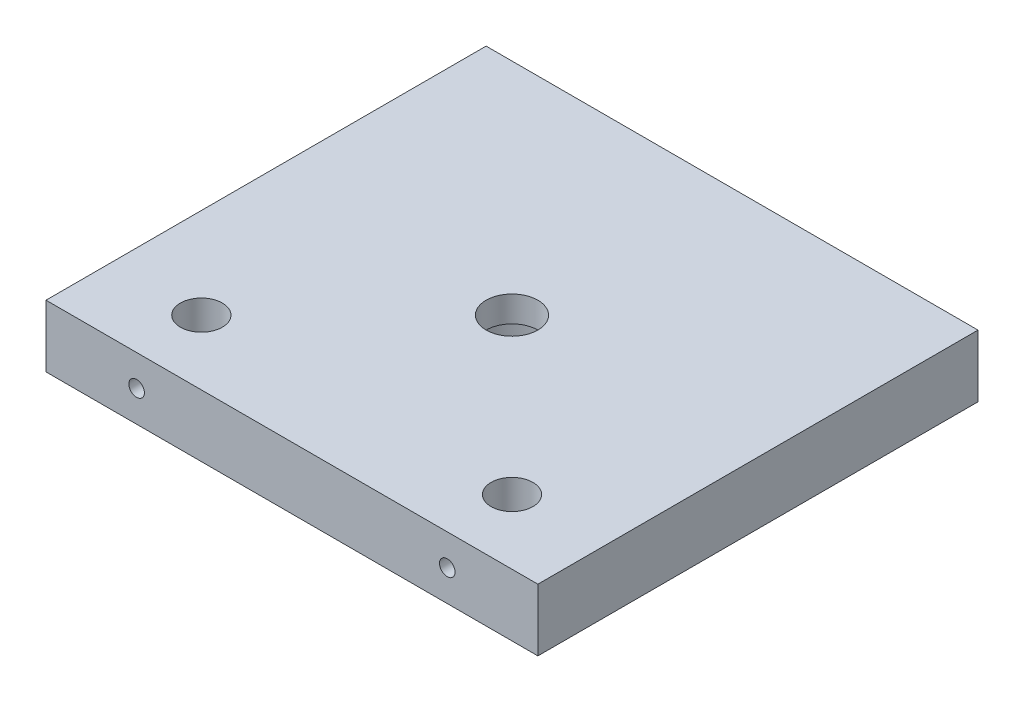
ISO-10303-21;
HEADER;
FILE_DESCRIPTION(('STEP AP214'),'2;1');
FILE_NAME('part.step','',(''),(''),'','','');
FILE_SCHEMA(('AUTOMOTIVE_DESIGN { 1 0 10303 214 1 1 1 1 }'));
ENDSEC;
DATA;
#1=APPLICATION_CONTEXT('core data for automotive mechanical design processes');
#2=APPLICATION_PROTOCOL_DEFINITION('international standard','automotive_design',2000,#1);
#3=PRODUCT_CONTEXT('',#1,'mechanical');
#4=PRODUCT('Part','Part','',(#3));
#5=PRODUCT_RELATED_PRODUCT_CATEGORY('part','',(#4));
#6=PRODUCT_DEFINITION_FORMATION('','',#4);
#7=PRODUCT_DEFINITION_CONTEXT('part definition',#1,'design');
#8=PRODUCT_DEFINITION('design','',#6,#7);
#9=PRODUCT_DEFINITION_SHAPE('','',#8);
#10=(LENGTH_UNIT() NAMED_UNIT(*) SI_UNIT(.MILLI.,.METRE.));
#11=(NAMED_UNIT(*) PLANE_ANGLE_UNIT() SI_UNIT($,.RADIAN.));
#12=(NAMED_UNIT(*) SI_UNIT($,.STERADIAN.) SOLID_ANGLE_UNIT());
#13=UNCERTAINTY_MEASURE_WITH_UNIT(LENGTH_MEASURE(1.E-05),#10,'distance_accuracy_value','');
#14=(GEOMETRIC_REPRESENTATION_CONTEXT(3) GLOBAL_UNCERTAINTY_ASSIGNED_CONTEXT((#13)) GLOBAL_UNIT_ASSIGNED_CONTEXT((#10,
#11,#12)) REPRESENTATION_CONTEXT('',''));
#15=CARTESIAN_POINT('',(0.,0.,0.));
#16=DIRECTION('',(0.,0.,1.));
#17=DIRECTION('',(1.,0.,0.));
#18=AXIS2_PLACEMENT_3D('',#15,#16,#17);
#19=CARTESIAN_POINT('',(0.,6.,42.5));
#20=DIRECTION('',(0.,-1.,0.));
#21=DIRECTION('',(0.,0.,-1.));
#22=AXIS2_PLACEMENT_3D('',#19,#20,#21);
#23=CYLINDRICAL_SURFACE('',#22,5.);
#24=CARTESIAN_POINT('',(0.,6.,42.5));
#25=DIRECTION('',(0.,-1.,0.));
#26=DIRECTION('',(0.,0.,-1.));
#27=AXIS2_PLACEMENT_3D('',#24,#25,#26);
#28=CIRCLE('',#27,5.);
#29=CARTESIAN_POINT('',(0.,6.,37.5));
#30=VERTEX_POINT('',#29);
#31=EDGE_CURVE('E121',#30,#30,#28,.T.);
#32=ORIENTED_EDGE('',*,*,#31,.F.);
#33=EDGE_LOOP('',(#32));
#34=FACE_BOUND('',#33,.T.);
#35=CARTESIAN_POINT('',(0.,1.,42.5));
#36=DIRECTION('',(0.,-1.,0.));
#37=DIRECTION('',(0.,0.,-1.));
#38=AXIS2_PLACEMENT_3D('',#35,#36,#37);
#39=CIRCLE('',#38,5.);
#40=CARTESIAN_POINT('',(0.,1.,37.5));
#41=VERTEX_POINT('',#40);
#42=EDGE_CURVE('E36',#41,#41,#39,.F.);
#43=ORIENTED_EDGE('',*,*,#42,.F.);
#44=EDGE_LOOP('',(#43));
#45=FACE_BOUND('',#44,.T.);
#46=ADVANCED_FACE('F32',(#34,#45),#23,.F.);
#47=CARTESIAN_POINT('',(47.5,6.,85.));
#48=DIRECTION('',(-1.,0.,0.));
#49=DIRECTION('',(0.,0.,1.));
#50=AXIS2_PLACEMENT_3D('',#47,#48,#49);
#51=PLANE('',#50);
#52=DIRECTION('',(0.,1.,0.));
#53=VECTOR('',#52,1.);
#54=CARTESIAN_POINT('',(47.5,6.,0.));
#55=LINE('',#54,#53);
#56=CARTESIAN_POINT('',(47.5,-6.,0.));
#57=VERTEX_POINT('',#56);
#58=CARTESIAN_POINT('',(47.5,6.,0.));
#59=VERTEX_POINT('',#58);
#60=EDGE_CURVE('E98',#57,#59,#55,.T.);
#61=ORIENTED_EDGE('',*,*,#60,.T.);
#62=DIRECTION('',(0.,0.,-1.));
#63=VECTOR('',#62,1.);
#64=CARTESIAN_POINT('',(47.5,6.,85.));
#65=LINE('',#64,#63);
#66=CARTESIAN_POINT('',(47.5,6.,85.));
#67=VERTEX_POINT('',#66);
#68=EDGE_CURVE('E11',#67,#59,#65,.T.);
#69=ORIENTED_EDGE('',*,*,#68,.F.);
#70=DIRECTION('',(0.,1.,0.));
#71=VECTOR('',#70,1.);
#72=CARTESIAN_POINT('',(47.5,6.,85.));
#73=LINE('',#72,#71);
#74=CARTESIAN_POINT('',(47.5,-6.,85.));
#75=VERTEX_POINT('',#74);
#76=EDGE_CURVE('E85',#75,#67,#73,.T.);
#77=ORIENTED_EDGE('',*,*,#76,.F.);
#78=DIRECTION('',(0.,0.,-1.));
#79=VECTOR('',#78,1.);
#80=CARTESIAN_POINT('',(47.5,-6.,85.));
#81=LINE('',#80,#79);
#82=EDGE_CURVE('E94',#75,#57,#81,.T.);
#83=ORIENTED_EDGE('',*,*,#82,.T.);
#84=EDGE_LOOP('',(#61,#69,#77,#83));
#85=FACE_BOUND('',#84,.T.);
#86=ADVANCED_FACE('F34',(#85),#51,.F.);
#87=CARTESIAN_POINT('',(-47.5,6.,85.));
#88=DIRECTION('',(0.,-1.,0.));
#89=DIRECTION('',(0.,0.,-1.));
#90=AXIS2_PLACEMENT_3D('',#87,#88,#89);
#91=PLANE('',#90);
#92=ORIENTED_EDGE('',*,*,#31,.T.);
#93=EDGE_LOOP('',(#92));
#94=FACE_BOUND('',#93,.T.);
#95=CARTESIAN_POINT('',(30.,6.,72.5));
#96=DIRECTION('',(0.,-1.,0.));
#97=DIRECTION('',(0.,0.,-1.));
#98=AXIS2_PLACEMENT_3D('',#95,#96,#97);
#99=CIRCLE('',#98,4.05);
#100=CARTESIAN_POINT('',(30.,6.,68.45));
#101=VERTEX_POINT('',#100);
#102=EDGE_CURVE('E115',#101,#101,#99,.T.);
#103=ORIENTED_EDGE('',*,*,#102,.T.);
#104=EDGE_LOOP('',(#103));
#105=FACE_BOUND('',#104,.T.);
#106=CARTESIAN_POINT('',(-30.,6.,72.5));
#107=DIRECTION('',(0.,-1.,0.));
#108=DIRECTION('',(0.,0.,-1.));
#109=AXIS2_PLACEMENT_3D('',#106,#107,#108);
#110=CIRCLE('',#109,4.05);
#111=CARTESIAN_POINT('',(-30.,6.,68.45));
#112=VERTEX_POINT('',#111);
#113=EDGE_CURVE('E101',#112,#112,#110,.T.);
#114=ORIENTED_EDGE('',*,*,#113,.T.);
#115=EDGE_LOOP('',(#114));
#116=FACE_BOUND('',#115,.T.);
#117=DIRECTION('',(-1.,0.,0.));
#118=VECTOR('',#117,1.);
#119=CARTESIAN_POINT('',(-47.5,6.,0.));
#120=LINE('',#119,#118);
#121=CARTESIAN_POINT('',(-47.5,6.,0.));
#122=VERTEX_POINT('',#121);
#123=EDGE_CURVE('E89',#59,#122,#120,.T.);
#124=ORIENTED_EDGE('',*,*,#123,.T.);
#125=DIRECTION('',(0.,0.,-1.));
#126=VECTOR('',#125,1.);
#127=CARTESIAN_POINT('',(-47.5,6.,85.));
#128=LINE('',#127,#126);
#129=CARTESIAN_POINT('',(-47.5,6.,85.));
#130=VERTEX_POINT('',#129);
#131=EDGE_CURVE('E42',#130,#122,#128,.T.);
#132=ORIENTED_EDGE('',*,*,#131,.F.);
#133=DIRECTION('',(-1.,0.,0.));
#134=VECTOR('',#133,1.);
#135=CARTESIAN_POINT('',(-47.5,6.,85.));
#136=LINE('',#135,#134);
#137=EDGE_CURVE('E80',#67,#130,#136,.T.);
#138=ORIENTED_EDGE('',*,*,#137,.F.);
#139=ORIENTED_EDGE('',*,*,#68,.T.);
#140=EDGE_LOOP('',(#124,#132,#138,#139));
#141=FACE_BOUND('',#140,.T.);
#142=ADVANCED_FACE('F88',(#94,#105,#116,#141),#91,.F.);
#143=CARTESIAN_POINT('',(-47.5,6.,85.));
#144=DIRECTION('',(1.,0.,0.));
#145=DIRECTION('',(0.,1.,0.));
#146=AXIS2_PLACEMENT_3D('',#143,#144,#145);
#147=PLANE('',#146);
#148=DIRECTION('',(0.,-1.,0.));
#149=VECTOR('',#148,1.);
#150=CARTESIAN_POINT('',(-47.5,6.,0.));
#151=LINE('',#150,#149);
#152=CARTESIAN_POINT('',(-47.5,-6.,0.));
#153=VERTEX_POINT('',#152);
#154=EDGE_CURVE('E67',#122,#153,#151,.T.);
#155=ORIENTED_EDGE('',*,*,#154,.T.);
#156=DIRECTION('',(0.,0.,-1.));
#157=VECTOR('',#156,1.);
#158=CARTESIAN_POINT('',(-47.5,-6.,85.));
#159=LINE('',#158,#157);
#160=CARTESIAN_POINT('',(-47.5,-6.,85.));
#161=VERTEX_POINT('',#160);
#162=EDGE_CURVE('E90',#161,#153,#159,.T.);
#163=ORIENTED_EDGE('',*,*,#162,.F.);
#164=DIRECTION('',(0.,-1.,0.));
#165=VECTOR('',#164,1.);
#166=CARTESIAN_POINT('',(-47.5,6.,85.));
#167=LINE('',#166,#165);
#168=EDGE_CURVE('E83',#130,#161,#167,.T.);
#169=ORIENTED_EDGE('',*,*,#168,.F.);
#170=ORIENTED_EDGE('',*,*,#131,.T.);
#171=EDGE_LOOP('',(#155,#163,#169,#170));
#172=FACE_BOUND('',#171,.T.);
#173=ADVANCED_FACE('F92',(#172),#147,.F.);
#174=CARTESIAN_POINT('',(-47.5,-6.,85.));
#175=DIRECTION('',(0.,1.,0.));
#176=DIRECTION('',(0.,0.,1.));
#177=AXIS2_PLACEMENT_3D('',#174,#175,#176);
#178=PLANE('',#177);
#179=CARTESIAN_POINT('',(0.,-6.,42.5));
#180=DIRECTION('',(0.,-1.,0.));
#181=DIRECTION('',(0.,0.,-1.));
#182=AXIS2_PLACEMENT_3D('',#179,#180,#181);
#183=CIRCLE('',#182,11.05);
#184=CARTESIAN_POINT('',(0.,-6.,31.45));
#185=VERTEX_POINT('',#184);
#186=EDGE_CURVE('E126',#185,#185,#183,.T.);
#187=ORIENTED_EDGE('',*,*,#186,.F.);
#188=EDGE_LOOP('',(#187));
#189=FACE_BOUND('',#188,.T.);
#190=CARTESIAN_POINT('',(30.,-6.,72.5));
#191=DIRECTION('',(0.,-1.,0.));
#192=DIRECTION('',(0.,0.,-1.));
#193=AXIS2_PLACEMENT_3D('',#190,#191,#192);
#194=CIRCLE('',#193,4.05);
#195=CARTESIAN_POINT('',(30.,-6.,68.45));
#196=VERTEX_POINT('',#195);
#197=EDGE_CURVE('E118',#196,#196,#194,.T.);
#198=ORIENTED_EDGE('',*,*,#197,.F.);
#199=EDGE_LOOP('',(#198));
#200=FACE_BOUND('',#199,.T.);
#201=CARTESIAN_POINT('',(-30.,-6.,72.5));
#202=DIRECTION('',(0.,-1.,0.));
#203=DIRECTION('',(0.,0.,-1.));
#204=AXIS2_PLACEMENT_3D('',#201,#202,#203);
#205=CIRCLE('',#204,4.05);
#206=CARTESIAN_POINT('',(-30.,-6.,68.45));
#207=VERTEX_POINT('',#206);
#208=EDGE_CURVE('E112',#207,#207,#205,.T.);
#209=ORIENTED_EDGE('',*,*,#208,.F.);
#210=EDGE_LOOP('',(#209));
#211=FACE_BOUND('',#210,.T.);
#212=DIRECTION('',(1.,0.,0.));
#213=VECTOR('',#212,1.);
#214=CARTESIAN_POINT('',(-47.5,-6.,0.));
#215=LINE('',#214,#213);
#216=EDGE_CURVE('E73',#153,#57,#215,.T.);
#217=ORIENTED_EDGE('',*,*,#216,.T.);
#218=ORIENTED_EDGE('',*,*,#82,.F.);
#219=DIRECTION('',(1.,0.,0.));
#220=VECTOR('',#219,1.);
#221=CARTESIAN_POINT('',(-47.5,-6.,85.));
#222=LINE('',#221,#220);
#223=EDGE_CURVE('E50',#161,#75,#222,.T.);
#224=ORIENTED_EDGE('',*,*,#223,.F.);
#225=ORIENTED_EDGE('',*,*,#162,.T.);
#226=EDGE_LOOP('',(#217,#218,#224,#225));
#227=FACE_BOUND('',#226,.T.);
#228=ADVANCED_FACE('F106',(#189,#200,#211,#227),#178,.F.);
#229=CARTESIAN_POINT('',(0.,0.,85.));
#230=DIRECTION('',(0.,0.,1.));
#231=DIRECTION('',(1.,0.,0.));
#232=AXIS2_PLACEMENT_3D('',#229,#230,#231);
#233=PLANE('',#232);
#234=CARTESIAN_POINT('',(-30.,0.,85.));
#235=DIRECTION('',(0.,0.,1.));
#236=DIRECTION('',(1.,0.,0.));
#237=AXIS2_PLACEMENT_3D('',#234,#235,#236);
#238=CIRCLE('',#237,1.5);
#239=CARTESIAN_POINT('',(-28.5,0.,85.));
#240=VERTEX_POINT('',#239);
#241=EDGE_CURVE('E142',#240,#240,#238,.T.);
#242=ORIENTED_EDGE('',*,*,#241,.F.);
#243=EDGE_LOOP('',(#242));
#244=FACE_BOUND('',#243,.T.);
#245=CARTESIAN_POINT('',(30.,0.,85.));
#246=DIRECTION('',(0.,0.,1.));
#247=DIRECTION('',(1.,0.,0.));
#248=AXIS2_PLACEMENT_3D('',#245,#246,#247);
#249=CIRCLE('',#248,1.5);
#250=CARTESIAN_POINT('',(31.5,0.,85.));
#251=VERTEX_POINT('',#250);
#252=EDGE_CURVE('E130',#251,#251,#249,.T.);
#253=ORIENTED_EDGE('',*,*,#252,.F.);
#254=EDGE_LOOP('',(#253));
#255=FACE_BOUND('',#254,.T.);
#256=ORIENTED_EDGE('',*,*,#76,.T.);
#257=ORIENTED_EDGE('',*,*,#137,.T.);
#258=ORIENTED_EDGE('',*,*,#168,.T.);
#259=ORIENTED_EDGE('',*,*,#223,.T.);
#260=EDGE_LOOP('',(#256,#257,#258,#259));
#261=FACE_BOUND('',#260,.T.);
#262=ADVANCED_FACE('F81',(#244,#255,#261),#233,.T.);
#263=CARTESIAN_POINT('',(0.,0.,0.));
#264=DIRECTION('',(0.,0.,1.));
#265=DIRECTION('',(1.,0.,0.));
#266=AXIS2_PLACEMENT_3D('',#263,#264,#265);
#267=PLANE('',#266);
#268=ORIENTED_EDGE('',*,*,#60,.F.);
#269=ORIENTED_EDGE('',*,*,#216,.F.);
#270=ORIENTED_EDGE('',*,*,#154,.F.);
#271=ORIENTED_EDGE('',*,*,#123,.F.);
#272=EDGE_LOOP('',(#268,#269,#270,#271));
#273=FACE_BOUND('',#272,.T.);
#274=ADVANCED_FACE('F109',(#273),#267,.F.);
#275=CARTESIAN_POINT('',(-30.,6.,72.5));
#276=DIRECTION('',(0.,-1.,0.));
#277=DIRECTION('',(0.,0.,-1.));
#278=AXIS2_PLACEMENT_3D('',#275,#276,#277);
#279=CYLINDRICAL_SURFACE('',#278,4.05);
#280=CARTESIAN_POINT('',(-28.5,0.,76.2619808611953));
#281=CARTESIAN_POINT('',(-28.499997314737,-0.0810891334683263,76.2619783928045));
#282=CARTESIAN_POINT('',(-28.5065973592327,-0.162160309047721,76.2646311539495));
#283=CARTESIAN_POINT('',(-28.5327065737687,-0.321863243037455,76.274883341602));
#284=CARTESIAN_POINT('',(-28.5522156126098,-0.400495026231791,76.2824827178351));
#285=CARTESIAN_POINT('',(-28.6033328710849,-0.552970015146571,76.3016517492077));
#286=CARTESIAN_POINT('',(-28.6349127361642,-0.626823972244057,76.3132120934298));
#287=CARTESIAN_POINT('',(-28.7091751195573,-0.768213906906506,76.3389856745783));
#288=CARTESIAN_POINT('',(-28.7518608833474,-0.835748029769575,76.3531996866424));
#289=CARTESIAN_POINT('',(-28.8493389051183,-0.965853976219434,76.3834508721137));
#290=CARTESIAN_POINT('',(-28.9045816891257,-1.02807608539166,76.3995407791495));
#291=CARTESIAN_POINT('',(-29.0246490643916,-1.14261844136584,76.4312902576168));
#292=CARTESIAN_POINT('',(-29.089475630863,-1.19493664189611,76.4469497395469));
#293=CARTESIAN_POINT('',(-29.2295135857313,-1.28985913712174,76.4766988909703));
#294=CARTESIAN_POINT('',(-29.3049975451178,-1.33208488813537,76.4907195036974));
#295=CARTESIAN_POINT('',(-29.4626083653082,-1.40309423078099,76.5149787680496));
#296=CARTESIAN_POINT('',(-29.5447329720443,-1.43188236132632,76.5252186964565));
#297=CARTESIAN_POINT('',(-29.709618342132,-1.47397749136628,76.5403885855827));
#298=CARTESIAN_POINT('',(-29.792206189695,-1.48788621560969,76.545524285012));
#299=CARTESIAN_POINT('',(-29.9586927605687,-1.50175400860525,76.5506444800488));
#300=CARTESIAN_POINT('',(-30.0425910595962,-1.50171750246429,76.5506306097202));
#301=CARTESIAN_POINT('',(-30.2050102957497,-1.48804993868762,76.5455850984626));
#302=CARTESIAN_POINT('',(-30.2835952941982,-1.47507528246144,76.5407957372615));
#303=CARTESIAN_POINT('',(-30.4373815523277,-1.43700170605454,76.5270535664788));
#304=CARTESIAN_POINT('',(-30.5125825727121,-1.41190192991977,76.518100462966));
#305=CARTESIAN_POINT('',(-30.6587528013293,-1.34997692309171,76.4967591559646));
#306=CARTESIAN_POINT('',(-30.7296453075566,-1.31298775789584,76.4843232590446));
#307=CARTESIAN_POINT('',(-30.8643913706546,-1.22847777825054,76.4572790398247));
#308=CARTESIAN_POINT('',(-30.9282426783346,-1.1809536130839,76.44267002684));
#309=CARTESIAN_POINT('',(-31.0509658559265,-1.0735427882489,76.4118029818039));
#310=CARTESIAN_POINT('',(-31.1093439009455,-1.01310443474047,76.3954984243782));
#311=CARTESIAN_POINT('',(-31.2153190318627,-0.883192548762243,76.3637503957587));
#312=CARTESIAN_POINT('',(-31.2629135453125,-0.813716866615781,76.34830713069));
#313=CARTESIAN_POINT('',(-31.3468823649577,-0.665799377193902,76.3197412833271));
#314=CARTESIAN_POINT('',(-31.3829975968804,-0.587198797366458,76.3066747987483));
#315=CARTESIAN_POINT('',(-31.4412945922282,-0.424420518637647,76.2849899492638));
#316=CARTESIAN_POINT('',(-31.4634838805418,-0.340245858924454,76.2763691825625));
#317=CARTESIAN_POINT('',(-31.4921896715132,-0.173578841001167,76.2651157106558));
#318=CARTESIAN_POINT('',(-31.4994885862334,-0.0912415305431188,76.2621844890466));
#319=CARTESIAN_POINT('',(-31.500459045415,0.0735155840518162,76.261798113694));
#320=CARTESIAN_POINT('',(-31.4941338764604,0.155935363500273,76.2643416392585));
#321=CARTESIAN_POINT('',(-31.4687444769862,0.314559610163147,76.2743156093745));
#322=CARTESIAN_POINT('',(-31.4502776486839,0.390875782779827,76.2815166342019));
#323=CARTESIAN_POINT('',(-31.4018766861181,0.539293906964582,76.2997244024622));
#324=CARTESIAN_POINT('',(-31.3719402375325,0.611395004635053,76.3107319139182));
#325=CARTESIAN_POINT('',(-31.3002061083661,0.752291982132171,76.3358121007634));
#326=CARTESIAN_POINT('',(-31.2580117406083,0.820867931809038,76.349982838958));
#327=CARTESIAN_POINT('',(-31.1633846350649,0.950244598484322,76.379625145236));
#328=CARTESIAN_POINT('',(-31.1109482303549,1.01104251779841,76.395097178085));
#329=CARTESIAN_POINT('',(-30.9935041262148,1.12701834020833,76.4267499585512));
#330=CARTESIAN_POINT('',(-30.9279212370453,1.18161983983997,76.4429156982628));
#331=CARTESIAN_POINT('',(-30.7881263448793,1.2791078364043,76.4732185032708));
#332=CARTESIAN_POINT('',(-30.7139143631044,1.32199436214671,76.4873555735559));
#333=CARTESIAN_POINT('',(-30.5590612040618,1.39453528925229,76.5119902346205));
#334=CARTESIAN_POINT('',(-30.4784465196371,1.42424117740281,76.5225019504079));
#335=CARTESIAN_POINT('',(-30.3128876221761,1.46950903351663,76.538750451691));
#336=CARTESIAN_POINT('',(-30.2279454063983,1.48507746490673,76.5444894191124));
#337=CARTESIAN_POINT('',(-30.0613592363511,1.50094439553547,76.5503438740335));
#338=CARTESIAN_POINT('',(-29.9798032651369,1.50206271323805,76.5507612591996));
#339=CARTESIAN_POINT('',(-29.8177161458208,1.49109642243981,76.5467075806102));
#340=CARTESIAN_POINT('',(-29.7371848802896,1.47901334083151,76.5422370821941));
#341=CARTESIAN_POINT('',(-29.5813374302406,1.44256012810747,76.5290447970322));
#342=CARTESIAN_POINT('',(-29.5059434137686,1.41848319870074,76.5204246150346));
#343=CARTESIAN_POINT('',(-29.3602561138345,1.35901504434104,76.49983077314));
#344=CARTESIAN_POINT('',(-29.2899637976753,1.32362168058717,76.4878564793705));
#345=CARTESIAN_POINT('',(-29.1532777321977,1.24084974508667,76.4611378823322));
#346=CARTESIAN_POINT('',(-29.0871673462468,1.19303426784743,76.4462991530481));
#347=CARTESIAN_POINT('',(-28.9636535486168,1.08747024196811,76.4156790217677));
#348=CARTESIAN_POINT('',(-28.9062532263973,1.0297181842499,76.3998972880413));
#349=CARTESIAN_POINT('',(-28.7987697852893,0.902404373946857,76.3681841258712));
#350=CARTESIAN_POINT('',(-28.7492113873448,0.832389533485982,76.3522863604418));
#351=CARTESIAN_POINT('',(-28.6625500703115,0.684522213395976,76.3230651787182));
#352=CARTESIAN_POINT('',(-28.625447860883,0.606669287539778,76.3097419091177));
#353=CARTESIAN_POINT('',(-28.5639832947332,0.442478256521022,76.2870142870943));
#354=CARTESIAN_POINT('',(-28.5400865456618,0.355943875708578,76.2777552807865));
#355=CARTESIAN_POINT('',(-28.5081012456911,0.179597624019246,76.2652417806732));
#356=CARTESIAN_POINT('',(-28.5000029733191,0.0897878033445274,76.2619835943778));
#357=CARTESIAN_POINT('',(-28.5,0.,76.2619808611953));
#358=B_SPLINE_CURVE_WITH_KNOTS('',3,(#280,#281,#282,#283,#284,#285,#286,#287,#288,#289,#290,
#291,#292,#293,#294,#295,#296,#297,#298,#299,#300,#301,#302,#303,#304,#305,#306,#307,#308,#309,
#310,#311,#312,#313,#314,#315,#316,#317,#318,#319,#320,#321,#322,#323,#324,#325,#326,#327,#328,
#329,#330,#331,#332,#333,#334,#335,#336,#337,#338,#339,#340,#341,#342,#343,#344,#345,#346,#347,
#348,#349,#350,#351,#352,#353,#354,#355,#356,#357),.UNSPECIFIED.,.T.,.F.,(4,2,2,2,2,2,2,2,2,2,2,
2,2,2,2,2,2,2,2,2,2,2,2,2,2,2,2,2,2,2,2,2,2,2,2,2,2,2,4),(0.,0.24293326478076,0.485864060573544,
0.728227680714844,0.970662206472731,1.22377778926956,1.4769456119752,1.73848739194063,
1.99994076517857,2.25036705443976,2.50071387838224,2.73897448477361,2.9772519132621,
3.2189668748059,3.46075882576672,3.7163830436328,3.97206817747706,4.2331702628709,
4.49413113990898,4.74098468620363,4.9877786898459,5.2232568302116,5.45878251003317,
5.7029934628183,5.94729201048287,6.2066301998645,6.46596775147042,6.72428315168352,
6.98248039454194,7.22596012354545,7.46941169431969,7.70718414319924,7.94500155755304,
8.19270089795979,8.44048789297795,8.70095423176163,8.96143540744973,9.23059451546761,
9.49958794616568),.UNSPECIFIED.);
#359=CARTESIAN_POINT('',(-28.5,0.,76.2619808611953));
#360=VERTEX_POINT('',#359);
#361=EDGE_CURVE('E155',#360,#360,#358,.T.);
#362=ORIENTED_EDGE('',*,*,#361,.F.);
#363=EDGE_LOOP('',(#362));
#364=FACE_BOUND('',#363,.T.);
#365=ORIENTED_EDGE('',*,*,#113,.F.);
#366=EDGE_LOOP('',(#365));
#367=FACE_BOUND('',#366,.T.);
#368=ORIENTED_EDGE('',*,*,#208,.T.);
#369=EDGE_LOOP('',(#368));
#370=FACE_BOUND('',#369,.T.);
#371=ADVANCED_FACE('F178',(#364,#367,#370),#279,.F.);
#372=CARTESIAN_POINT('',(30.,6.,72.5));
#373=DIRECTION('',(0.,-1.,0.));
#374=DIRECTION('',(0.,0.,-1.));
#375=AXIS2_PLACEMENT_3D('',#372,#373,#374);
#376=CYLINDRICAL_SURFACE('',#375,4.05);
#377=CARTESIAN_POINT('',(31.5,0.,76.2619808611953));
#378=CARTESIAN_POINT('',(31.500002685263,-0.0810891334683268,76.2619783928045));
#379=CARTESIAN_POINT('',(31.4934026407673,-0.162160309047722,76.2646311539495));
#380=CARTESIAN_POINT('',(31.4672934262313,-0.321863243037456,76.274883341602));
#381=CARTESIAN_POINT('',(31.4477843873903,-0.400495026231791,76.2824827178351));
#382=CARTESIAN_POINT('',(31.3966671289151,-0.55297001514657,76.3016517492077));
#383=CARTESIAN_POINT('',(31.3650872638358,-0.626823972244056,76.3132120934298));
#384=CARTESIAN_POINT('',(31.2908248804427,-0.768213906906506,76.3389856745783));
#385=CARTESIAN_POINT('',(31.2481391166527,-0.835748029769575,76.3531996866424));
#386=CARTESIAN_POINT('',(31.1506610948817,-0.965853976219435,76.3834508721137));
#387=CARTESIAN_POINT('',(31.0954183108743,-1.02807608539166,76.3995407791495));
#388=CARTESIAN_POINT('',(30.9753509356084,-1.14261844136584,76.4312902576168));
#389=CARTESIAN_POINT('',(30.910524369137,-1.19493664189611,76.4469497395469));
#390=CARTESIAN_POINT('',(30.7704864142687,-1.28985913712174,76.4766988909703));
#391=CARTESIAN_POINT('',(30.6950024548822,-1.33208488813537,76.4907195036974));
#392=CARTESIAN_POINT('',(30.5373916346918,-1.40309423078099,76.5149787680496));
#393=CARTESIAN_POINT('',(30.4552670279557,-1.43188236132632,76.5252186964565));
#394=CARTESIAN_POINT('',(30.290381657868,-1.47397749136628,76.5403885855827));
#395=CARTESIAN_POINT('',(30.207793810305,-1.48788621560969,76.545524285012));
#396=CARTESIAN_POINT('',(30.0413072394313,-1.50175400860525,76.5506444800488));
#397=CARTESIAN_POINT('',(29.9574089404038,-1.50171750246429,76.5506306097202));
#398=CARTESIAN_POINT('',(29.7949897042503,-1.48804993868762,76.5455850984626));
#399=CARTESIAN_POINT('',(29.7164047058018,-1.47507528246144,76.5407957372615));
#400=CARTESIAN_POINT('',(29.5626184476724,-1.43700170605454,76.5270535664788));
#401=CARTESIAN_POINT('',(29.4874174272879,-1.41190192991976,76.518100462966));
#402=CARTESIAN_POINT('',(29.3412471986707,-1.34997692309171,76.4967591559646));
#403=CARTESIAN_POINT('',(29.2703546924434,-1.31298775789584,76.4843232590446));
#404=CARTESIAN_POINT('',(29.1356086293454,-1.22847777825054,76.4572790398247));
#405=CARTESIAN_POINT('',(29.0717573216654,-1.1809536130839,76.44267002684));
#406=CARTESIAN_POINT('',(28.9490341440735,-1.0735427882489,76.4118029818039));
#407=CARTESIAN_POINT('',(28.8906560990545,-1.01310443474047,76.3954984243782));
#408=CARTESIAN_POINT('',(28.7846809681373,-0.883192548762241,76.3637503957587));
#409=CARTESIAN_POINT('',(28.7370864546875,-0.81371686661578,76.34830713069));
#410=CARTESIAN_POINT('',(28.6531176350423,-0.665799377193902,76.319741283327));
#411=CARTESIAN_POINT('',(28.6170024031196,-0.587198797366458,76.3066747987483));
#412=CARTESIAN_POINT('',(28.5587054077718,-0.424420518637647,76.2849899492638));
#413=CARTESIAN_POINT('',(28.5365161194582,-0.340245858924453,76.2763691825625));
#414=CARTESIAN_POINT('',(28.5078103284869,-0.173578841001165,76.2651157106558));
#415=CARTESIAN_POINT('',(28.5005114137666,-0.0912415305431178,76.2621844890466));
#416=CARTESIAN_POINT('',(28.499540954585,0.0735155840518159,76.261798113694));
#417=CARTESIAN_POINT('',(28.5058661235396,0.155935363500272,76.2643416392585));
#418=CARTESIAN_POINT('',(28.5312555230138,0.314559610163145,76.2743156093744));
#419=CARTESIAN_POINT('',(28.5497223513161,0.390875782779824,76.2815166342019));
#420=CARTESIAN_POINT('',(28.5981233138819,0.539293906964579,76.2997244024622));
#421=CARTESIAN_POINT('',(28.6280597624675,0.61139500463505,76.3107319139182));
#422=CARTESIAN_POINT('',(28.6997938916339,0.752291982132168,76.3358121007634));
#423=CARTESIAN_POINT('',(28.7419882593917,0.820867931809036,76.3499828389579));
#424=CARTESIAN_POINT('',(28.8366153649351,0.95024459848432,76.379625145236));
#425=CARTESIAN_POINT('',(28.8890517696452,1.0110425177984,76.3950971780849));
#426=CARTESIAN_POINT('',(29.0064958737852,1.12701834020833,76.4267499585512));
#427=CARTESIAN_POINT('',(29.0720787629547,1.18161983983997,76.4429156982628));
#428=CARTESIAN_POINT('',(29.2118736551207,1.2791078364043,76.4732185032708));
#429=CARTESIAN_POINT('',(29.2860856368956,1.32199436214671,76.4873555735559));
#430=CARTESIAN_POINT('',(29.4409387959382,1.39453528925229,76.5119902346205));
#431=CARTESIAN_POINT('',(29.5215534803629,1.42424117740281,76.5225019504079));
#432=CARTESIAN_POINT('',(29.6871123778239,1.46950903351663,76.538750451691));
#433=CARTESIAN_POINT('',(29.7720545936017,1.48507746490673,76.5444894191124));
#434=CARTESIAN_POINT('',(29.9386407636489,1.50094439553547,76.5503438740335));
#435=CARTESIAN_POINT('',(30.0201967348631,1.50206271323805,76.5507612591996));
#436=CARTESIAN_POINT('',(30.1822838541792,1.49109642243981,76.5467075806102));
#437=CARTESIAN_POINT('',(30.2628151197104,1.47901334083151,76.5422370821941));
#438=CARTESIAN_POINT('',(30.4186625697594,1.44256012810747,76.5290447970322));
#439=CARTESIAN_POINT('',(30.4940565862314,1.41848319870074,76.5204246150346));
#440=CARTESIAN_POINT('',(30.6397438861655,1.35901504434104,76.49983077314));
#441=CARTESIAN_POINT('',(30.7100362023247,1.32362168058717,76.4878564793705));
#442=CARTESIAN_POINT('',(30.8467222678023,1.24084974508667,76.4611378823322));
#443=CARTESIAN_POINT('',(30.9128326537532,1.19303426784743,76.4462991530481));
#444=CARTESIAN_POINT('',(31.0363464513832,1.08747024196811,76.4156790217677));
#445=CARTESIAN_POINT('',(31.0937467736027,1.0297181842499,76.3998972880413));
#446=CARTESIAN_POINT('',(31.2012302147107,0.902404373946858,76.3681841258712));
#447=CARTESIAN_POINT('',(31.2507886126552,0.832389533485984,76.3522863604418));
#448=CARTESIAN_POINT('',(31.3374499296885,0.684522213395977,76.3230651787181));
#449=CARTESIAN_POINT('',(31.374552139117,0.606669287539778,76.3097419091177));
#450=CARTESIAN_POINT('',(31.4360167052668,0.442478256521022,76.2870142870943));
#451=CARTESIAN_POINT('',(31.4599134543382,0.355943875708578,76.2777552807865));
#452=CARTESIAN_POINT('',(31.4918987543089,0.179597624019247,76.2652417806732));
#453=CARTESIAN_POINT('',(31.4999970266809,0.0897878033445282,76.2619835943778));
#454=CARTESIAN_POINT('',(31.5,0.,76.2619808611953));
#455=B_SPLINE_CURVE_WITH_KNOTS('',3,(#377,#378,#379,#380,#381,#382,#383,#384,#385,#386,#387,
#388,#389,#390,#391,#392,#393,#394,#395,#396,#397,#398,#399,#400,#401,#402,#403,#404,#405,#406,
#407,#408,#409,#410,#411,#412,#413,#414,#415,#416,#417,#418,#419,#420,#421,#422,#423,#424,#425,
#426,#427,#428,#429,#430,#431,#432,#433,#434,#435,#436,#437,#438,#439,#440,#441,#442,#443,#444,
#445,#446,#447,#448,#449,#450,#451,#452,#453,#454),.UNSPECIFIED.,.T.,.F.,(4,2,2,2,2,2,2,2,2,2,2,
2,2,2,2,2,2,2,2,2,2,2,2,2,2,2,2,2,2,2,2,2,2,2,2,2,2,2,4),(0.,0.24293326478076,0.485864060573544,
0.728227680714843,0.970662206472731,1.22377778926956,1.4769456119752,1.73848739194063,
1.99994076517857,2.25036705443976,2.50071387838224,2.73897448477361,2.9772519132621,
3.2189668748059,3.46075882576672,3.7163830436328,3.97206817747706,4.2331702628709,
4.49413113990898,4.74098468620363,4.9877786898459,5.22325683021159,5.45878251003317,
5.70299346281829,5.94729201048287,6.20663019986451,6.46596775147041,6.72428315168352,
6.98248039454194,7.22596012354545,7.46941169431969,7.70718414319924,7.94500155755304,
8.19270089795979,8.44048789297795,8.70095423176163,8.96143540744973,9.23059451546761,
9.49958794616568),.UNSPECIFIED.);
#456=CARTESIAN_POINT('',(31.5,0.,76.2619808611953));
#457=VERTEX_POINT('',#456);
#458=EDGE_CURVE('E135',#457,#457,#455,.T.);
#459=ORIENTED_EDGE('',*,*,#458,.F.);
#460=EDGE_LOOP('',(#459));
#461=FACE_BOUND('',#460,.T.);
#462=ORIENTED_EDGE('',*,*,#102,.F.);
#463=EDGE_LOOP('',(#462));
#464=FACE_BOUND('',#463,.T.);
#465=ORIENTED_EDGE('',*,*,#197,.T.);
#466=EDGE_LOOP('',(#465));
#467=FACE_BOUND('',#466,.T.);
#468=ADVANCED_FACE('F174',(#461,#464,#467),#376,.F.);
#469=CARTESIAN_POINT('',(0.,1.,42.5));
#470=DIRECTION('',(0.,-1.,0.));
#471=DIRECTION('',(0.,0.,-1.));
#472=AXIS2_PLACEMENT_3D('',#469,#470,#471);
#473=PLANE('',#472);
#474=CARTESIAN_POINT('',(0.,1.,42.5));
#475=DIRECTION('',(0.,-1.,0.));
#476=DIRECTION('',(0.,0.,-1.));
#477=AXIS2_PLACEMENT_3D('',#474,#475,#476);
#478=CIRCLE('',#477,11.05);
#479=CARTESIAN_POINT('',(0.,1.,31.45));
#480=VERTEX_POINT('',#479);
#481=EDGE_CURVE('E129',#480,#480,#478,.T.);
#482=ORIENTED_EDGE('',*,*,#481,.T.);
#483=EDGE_LOOP('',(#482));
#484=FACE_BOUND('',#483,.T.);
#485=ORIENTED_EDGE('',*,*,#42,.T.);
#486=EDGE_LOOP('',(#485));
#487=FACE_BOUND('',#486,.T.);
#488=ADVANCED_FACE('F177',(#484,#487),#473,.T.);
#489=CARTESIAN_POINT('',(0.,1.,42.5));
#490=DIRECTION('',(0.,-1.,0.));
#491=DIRECTION('',(0.,0.,-1.));
#492=AXIS2_PLACEMENT_3D('',#489,#490,#491);
#493=CYLINDRICAL_SURFACE('',#492,11.05);
#494=ORIENTED_EDGE('',*,*,#481,.F.);
#495=EDGE_LOOP('',(#494));
#496=FACE_BOUND('',#495,.T.);
#497=ORIENTED_EDGE('',*,*,#186,.T.);
#498=EDGE_LOOP('',(#497));
#499=FACE_BOUND('',#498,.T.);
#500=ADVANCED_FACE('F171',(#496,#499),#493,.F.);
#501=CARTESIAN_POINT('',(30.,0.,-0.001000000000001));
#502=DIRECTION('',(0.,0.,1.));
#503=DIRECTION('',(1.,0.,0.));
#504=AXIS2_PLACEMENT_3D('',#501,#502,#503);
#505=CYLINDRICAL_SURFACE('',#504,1.5);
#506=ORIENTED_EDGE('',*,*,#252,.T.);
#507=EDGE_LOOP('',(#506));
#508=FACE_BOUND('',#507,.T.);
#509=ORIENTED_EDGE('',*,*,#458,.T.);
#510=EDGE_LOOP('',(#509));
#511=FACE_BOUND('',#510,.T.);
#512=ADVANCED_FACE('F144',(#508,#511),#505,.F.);
#513=CARTESIAN_POINT('',(-30.,0.,-0.001000000000001));
#514=DIRECTION('',(0.,0.,1.));
#515=DIRECTION('',(1.,0.,0.));
#516=AXIS2_PLACEMENT_3D('',#513,#514,#515);
#517=CYLINDRICAL_SURFACE('',#516,1.5);
#518=ORIENTED_EDGE('',*,*,#241,.T.);
#519=EDGE_LOOP('',(#518));
#520=FACE_BOUND('',#519,.T.);
#521=ORIENTED_EDGE('',*,*,#361,.T.);
#522=EDGE_LOOP('',(#521));
#523=FACE_BOUND('',#522,.T.);
#524=ADVANCED_FACE('F149',(#520,#523),#517,.F.);
#525=CLOSED_SHELL('',(#46,#86,#142,#173,#228,#262,#274,#371,#468,#488,#500,#512,#524));
#526=MANIFOLD_SOLID_BREP('B2',#525);
#527=ADVANCED_BREP_SHAPE_REPRESENTATION('',(#18,#526),#14);
#528=SHAPE_DEFINITION_REPRESENTATION(#9,#527);
ENDSEC;
END-ISO-10303-21;
